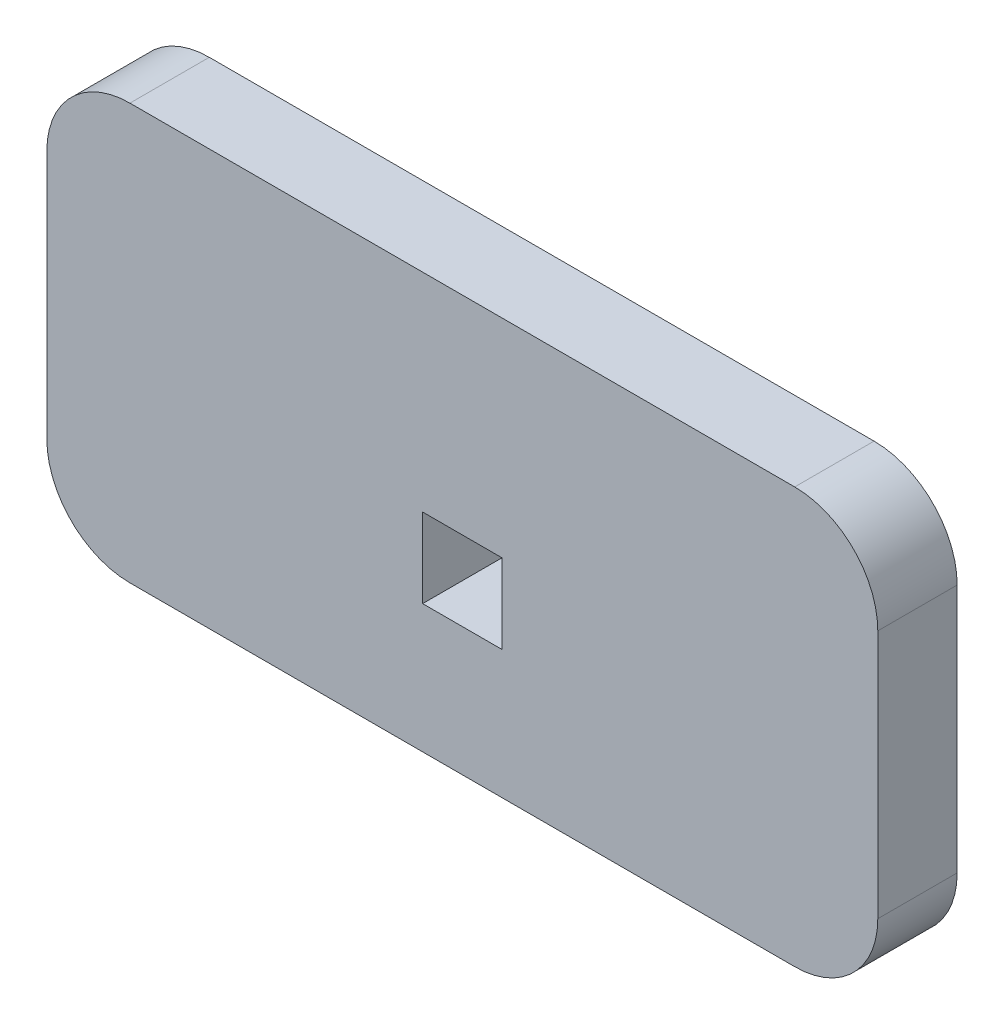
ISO-10303-21;
HEADER;
FILE_DESCRIPTION(('STEP AP214'),'2;1');
FILE_NAME('part.step','',(''),(''),'','','');
FILE_SCHEMA(('AUTOMOTIVE_DESIGN { 1 0 10303 214 1 1 1 1 }'));
ENDSEC;
DATA;
#1=APPLICATION_CONTEXT('core data for automotive mechanical design processes');
#2=APPLICATION_PROTOCOL_DEFINITION('international standard','automotive_design',2000,#1);
#3=PRODUCT_CONTEXT('',#1,'mechanical');
#4=PRODUCT('Part','Part','',(#3));
#5=PRODUCT_RELATED_PRODUCT_CATEGORY('part','',(#4));
#6=PRODUCT_DEFINITION_FORMATION('','',#4);
#7=PRODUCT_DEFINITION_CONTEXT('part definition',#1,'design');
#8=PRODUCT_DEFINITION('design','',#6,#7);
#9=PRODUCT_DEFINITION_SHAPE('','',#8);
#10=(LENGTH_UNIT() NAMED_UNIT(*) SI_UNIT(.MILLI.,.METRE.));
#11=(NAMED_UNIT(*) PLANE_ANGLE_UNIT() SI_UNIT($,.RADIAN.));
#12=(NAMED_UNIT(*) SI_UNIT($,.STERADIAN.) SOLID_ANGLE_UNIT());
#13=UNCERTAINTY_MEASURE_WITH_UNIT(LENGTH_MEASURE(1.E-05),#10,'distance_accuracy_value','');
#14=(GEOMETRIC_REPRESENTATION_CONTEXT(3) GLOBAL_UNCERTAINTY_ASSIGNED_CONTEXT((#13)) GLOBAL_UNIT_ASSIGNED_CONTEXT((#10,
#11,#12)) REPRESENTATION_CONTEXT('',''));
#15=CARTESIAN_POINT('',(0.,0.,0.));
#16=DIRECTION('',(0.,0.,1.));
#17=DIRECTION('',(1.,0.,0.));
#18=AXIS2_PLACEMENT_3D('',#15,#16,#17);
#19=CARTESIAN_POINT('',(5.,0.224799999999999,4.7752));
#20=DIRECTION('',(0.,0.,-1.));
#21=DIRECTION('',(-1.,0.,0.));
#22=AXIS2_PLACEMENT_3D('',#19,#20,#21);
#23=CYLINDRICAL_SURFACE('',#22,5.);
#24=CARTESIAN_POINT('',(5.,0.224799999999999,0.));
#25=DIRECTION('',(0.,0.,1.));
#26=DIRECTION('',(1.,0.,0.));
#27=AXIS2_PLACEMENT_3D('',#24,#25,#26);
#28=CIRCLE('',#27,5.);
#29=CARTESIAN_POINT('',(0.,0.224800000000035,0.));
#30=VERTEX_POINT('',#29);
#31=CARTESIAN_POINT('',(5.00000000000004,-4.7752,0.));
#32=VERTEX_POINT('',#31);
#33=EDGE_CURVE('E179',#30,#32,#28,.T.);
#34=ORIENTED_EDGE('',*,*,#33,.T.);
#35=DIRECTION('',(0.,0.,-1.));
#36=VECTOR('',#35,1.);
#37=CARTESIAN_POINT('',(5.00000000000004,-4.7752,4.7752));
#38=LINE('',#37,#36);
#39=CARTESIAN_POINT('',(5.00000000000004,-4.7752,4.7752));
#40=VERTEX_POINT('',#39);
#41=EDGE_CURVE('E11',#40,#32,#38,.T.);
#42=ORIENTED_EDGE('',*,*,#41,.F.);
#43=CARTESIAN_POINT('',(5.,0.224799999999999,4.7752));
#44=DIRECTION('',(0.,0.,1.));
#45=DIRECTION('',(1.,0.,0.));
#46=AXIS2_PLACEMENT_3D('',#43,#44,#45);
#47=CIRCLE('',#46,5.);
#48=CARTESIAN_POINT('',(0.,0.224800000000035,4.7752));
#49=VERTEX_POINT('',#48);
#50=EDGE_CURVE('E185',#49,#40,#47,.T.);
#51=ORIENTED_EDGE('',*,*,#50,.F.);
#52=DIRECTION('',(0.,0.,-1.));
#53=VECTOR('',#52,1.);
#54=CARTESIAN_POINT('',(0.,0.224800000000035,4.7752));
#55=LINE('',#54,#53);
#56=EDGE_CURVE('E211',#49,#30,#55,.T.);
#57=ORIENTED_EDGE('',*,*,#56,.T.);
#58=EDGE_LOOP('',(#34,#42,#51,#57));
#59=FACE_BOUND('',#58,.T.);
#60=ADVANCED_FACE('F47',(#59),#23,.T.);
#61=CARTESIAN_POINT('',(5.00000000000004,-4.7752,4.7752));
#62=DIRECTION('',(0.,1.,0.));
#63=DIRECTION('',(0.,0.,1.));
#64=AXIS2_PLACEMENT_3D('',#61,#62,#63);
#65=PLANE('',#64);
#66=DIRECTION('',(1.,0.,0.));
#67=VECTOR('',#66,1.);
#68=CARTESIAN_POINT('',(5.00000000000004,-4.7752,0.));
#69=LINE('',#68,#67);
#70=CARTESIAN_POINT('',(45.,-4.7752,0.));
#71=VERTEX_POINT('',#70);
#72=EDGE_CURVE('E215',#32,#71,#69,.T.);
#73=ORIENTED_EDGE('',*,*,#72,.T.);
#74=DIRECTION('',(0.,0.,-1.));
#75=VECTOR('',#74,1.);
#76=CARTESIAN_POINT('',(45.,-4.7752,4.7752));
#77=LINE('',#76,#75);
#78=CARTESIAN_POINT('',(45.,-4.7752,4.7752));
#79=VERTEX_POINT('',#78);
#80=EDGE_CURVE('E55',#79,#71,#77,.T.);
#81=ORIENTED_EDGE('',*,*,#80,.F.);
#82=DIRECTION('',(1.,0.,0.));
#83=VECTOR('',#82,1.);
#84=CARTESIAN_POINT('',(5.00000000000004,-4.7752,4.7752));
#85=LINE('',#84,#83);
#86=EDGE_CURVE('E189',#40,#79,#85,.T.);
#87=ORIENTED_EDGE('',*,*,#86,.F.);
#88=ORIENTED_EDGE('',*,*,#41,.T.);
#89=EDGE_LOOP('',(#73,#81,#87,#88));
#90=FACE_BOUND('',#89,.T.);
#91=ADVANCED_FACE('F284',(#90),#65,.F.);
#92=CARTESIAN_POINT('',(45.,0.224799999999999,4.7752));
#93=DIRECTION('',(0.,0.,-1.));
#94=DIRECTION('',(-1.,0.,0.));
#95=AXIS2_PLACEMENT_3D('',#92,#93,#94);
#96=CYLINDRICAL_SURFACE('',#95,5.);
#97=CARTESIAN_POINT('',(45.,0.224799999999999,0.));
#98=DIRECTION('',(0.,0.,1.));
#99=DIRECTION('',(1.,0.,0.));
#100=AXIS2_PLACEMENT_3D('',#97,#98,#99);
#101=CIRCLE('',#100,5.);
#102=CARTESIAN_POINT('',(50.,0.224800000000035,0.));
#103=VERTEX_POINT('',#102);
#104=EDGE_CURVE('E218',#71,#103,#101,.T.);
#105=ORIENTED_EDGE('',*,*,#104,.T.);
#106=DIRECTION('',(0.,0.,-1.));
#107=VECTOR('',#106,1.);
#108=CARTESIAN_POINT('',(50.,0.224800000000035,4.7752));
#109=LINE('',#108,#107);
#110=CARTESIAN_POINT('',(50.,0.224800000000035,4.7752));
#111=VERTEX_POINT('',#110);
#112=EDGE_CURVE('E254',#111,#103,#109,.T.);
#113=ORIENTED_EDGE('',*,*,#112,.F.);
#114=CARTESIAN_POINT('',(45.,0.224799999999999,4.7752));
#115=DIRECTION('',(0.,0.,1.));
#116=DIRECTION('',(1.,0.,0.));
#117=AXIS2_PLACEMENT_3D('',#114,#115,#116);
#118=CIRCLE('',#117,5.);
#119=EDGE_CURVE('E193',#79,#111,#118,.T.);
#120=ORIENTED_EDGE('',*,*,#119,.F.);
#121=ORIENTED_EDGE('',*,*,#80,.T.);
#122=EDGE_LOOP('',(#105,#113,#120,#121));
#123=FACE_BOUND('',#122,.T.);
#124=ADVANCED_FACE('F263',(#123),#96,.T.);
#125=CARTESIAN_POINT('',(50.,15.2248,4.7752));
#126=DIRECTION('',(-1.,0.,0.));
#127=DIRECTION('',(0.,0.,1.));
#128=AXIS2_PLACEMENT_3D('',#125,#126,#127);
#129=PLANE('',#128);
#130=DIRECTION('',(0.,1.,0.));
#131=VECTOR('',#130,1.);
#132=CARTESIAN_POINT('',(50.,15.2248,0.));
#133=LINE('',#132,#131);
#134=CARTESIAN_POINT('',(50.,15.2248,0.));
#135=VERTEX_POINT('',#134);
#136=EDGE_CURVE('E221',#103,#135,#133,.T.);
#137=ORIENTED_EDGE('',*,*,#136,.T.);
#138=DIRECTION('',(0.,0.,-1.));
#139=VECTOR('',#138,1.);
#140=CARTESIAN_POINT('',(50.,15.2248,4.7752));
#141=LINE('',#140,#139);
#142=CARTESIAN_POINT('',(50.,15.2248,4.7752));
#143=VERTEX_POINT('',#142);
#144=EDGE_CURVE('E250',#143,#135,#141,.T.);
#145=ORIENTED_EDGE('',*,*,#144,.F.);
#146=DIRECTION('',(0.,1.,0.));
#147=VECTOR('',#146,1.);
#148=CARTESIAN_POINT('',(50.,15.2248,4.7752));
#149=LINE('',#148,#147);
#150=EDGE_CURVE('E196',#111,#143,#149,.T.);
#151=ORIENTED_EDGE('',*,*,#150,.F.);
#152=ORIENTED_EDGE('',*,*,#112,.T.);
#153=EDGE_LOOP('',(#137,#145,#151,#152));
#154=FACE_BOUND('',#153,.T.);
#155=ADVANCED_FACE('F272',(#154),#129,.F.);
#156=CARTESIAN_POINT('',(45.,15.2248,4.7752));
#157=DIRECTION('',(0.,0.,-1.));
#158=DIRECTION('',(-1.,0.,0.));
#159=AXIS2_PLACEMENT_3D('',#156,#157,#158);
#160=CYLINDRICAL_SURFACE('',#159,5.);
#161=CARTESIAN_POINT('',(45.,15.2248,0.));
#162=DIRECTION('',(0.,0.,1.));
#163=DIRECTION('',(-1.,0.,0.));
#164=AXIS2_PLACEMENT_3D('',#161,#162,#163);
#165=CIRCLE('',#164,5.);
#166=CARTESIAN_POINT('',(45.,20.2248,0.));
#167=VERTEX_POINT('',#166);
#168=EDGE_CURVE('E224',#135,#167,#165,.T.);
#169=ORIENTED_EDGE('',*,*,#168,.T.);
#170=DIRECTION('',(0.,0.,-1.));
#171=VECTOR('',#170,1.);
#172=CARTESIAN_POINT('',(45.,20.2248,4.7752));
#173=LINE('',#172,#171);
#174=CARTESIAN_POINT('',(45.,20.2248,4.7752));
#175=VERTEX_POINT('',#174);
#176=EDGE_CURVE('E246',#175,#167,#173,.T.);
#177=ORIENTED_EDGE('',*,*,#176,.F.);
#178=CARTESIAN_POINT('',(45.,15.2248,4.7752));
#179=DIRECTION('',(0.,0.,1.));
#180=DIRECTION('',(-1.,0.,0.));
#181=AXIS2_PLACEMENT_3D('',#178,#179,#180);
#182=CIRCLE('',#181,5.);
#183=EDGE_CURVE('E199',#143,#175,#182,.T.);
#184=ORIENTED_EDGE('',*,*,#183,.F.);
#185=ORIENTED_EDGE('',*,*,#144,.T.);
#186=EDGE_LOOP('',(#169,#177,#184,#185));
#187=FACE_BOUND('',#186,.T.);
#188=ADVANCED_FACE('F276',(#187),#160,.T.);
#189=CARTESIAN_POINT('',(5.,20.2248,4.7752));
#190=DIRECTION('',(0.,-1.,0.));
#191=DIRECTION('',(0.,0.,-1.));
#192=AXIS2_PLACEMENT_3D('',#189,#190,#191);
#193=PLANE('',#192);
#194=DIRECTION('',(-1.,0.,0.));
#195=VECTOR('',#194,1.);
#196=CARTESIAN_POINT('',(5.,20.2248,0.));
#197=LINE('',#196,#195);
#198=CARTESIAN_POINT('',(5.,20.2248,0.));
#199=VERTEX_POINT('',#198);
#200=EDGE_CURVE('E227',#167,#199,#197,.T.);
#201=ORIENTED_EDGE('',*,*,#200,.T.);
#202=DIRECTION('',(0.,0.,-1.));
#203=VECTOR('',#202,1.);
#204=CARTESIAN_POINT('',(5.,20.2248,4.7752));
#205=LINE('',#204,#203);
#206=CARTESIAN_POINT('',(5.,20.2248,4.7752));
#207=VERTEX_POINT('',#206);
#208=EDGE_CURVE('E242',#207,#199,#205,.T.);
#209=ORIENTED_EDGE('',*,*,#208,.F.);
#210=DIRECTION('',(-1.,0.,0.));
#211=VECTOR('',#210,1.);
#212=CARTESIAN_POINT('',(5.,20.2248,4.7752));
#213=LINE('',#212,#211);
#214=EDGE_CURVE('E202',#175,#207,#213,.T.);
#215=ORIENTED_EDGE('',*,*,#214,.F.);
#216=ORIENTED_EDGE('',*,*,#176,.T.);
#217=EDGE_LOOP('',(#201,#209,#215,#216));
#218=FACE_BOUND('',#217,.T.);
#219=ADVANCED_FACE('F297',(#218),#193,.F.);
#220=CARTESIAN_POINT('',(5.,15.2248,4.7752));
#221=DIRECTION('',(0.,0.,-1.));
#222=DIRECTION('',(-1.,0.,0.));
#223=AXIS2_PLACEMENT_3D('',#220,#221,#222);
#224=CYLINDRICAL_SURFACE('',#223,5.);
#225=CARTESIAN_POINT('',(5.,15.2248,0.));
#226=DIRECTION('',(0.,0.,1.));
#227=DIRECTION('',(-1.,0.,0.));
#228=AXIS2_PLACEMENT_3D('',#225,#226,#227);
#229=CIRCLE('',#228,5.);
#230=CARTESIAN_POINT('',(0.,15.2248,0.));
#231=VERTEX_POINT('',#230);
#232=EDGE_CURVE('E230',#199,#231,#229,.T.);
#233=ORIENTED_EDGE('',*,*,#232,.T.);
#234=DIRECTION('',(0.,0.,-1.));
#235=VECTOR('',#234,1.);
#236=CARTESIAN_POINT('',(0.,15.2248,4.7752));
#237=LINE('',#236,#235);
#238=CARTESIAN_POINT('',(0.,15.2248,4.7752));
#239=VERTEX_POINT('',#238);
#240=EDGE_CURVE('E238',#239,#231,#237,.T.);
#241=ORIENTED_EDGE('',*,*,#240,.F.);
#242=CARTESIAN_POINT('',(5.,15.2248,4.7752));
#243=DIRECTION('',(0.,0.,1.));
#244=DIRECTION('',(-1.,0.,0.));
#245=AXIS2_PLACEMENT_3D('',#242,#243,#244);
#246=CIRCLE('',#245,5.);
#247=EDGE_CURVE('E205',#207,#239,#246,.T.);
#248=ORIENTED_EDGE('',*,*,#247,.F.);
#249=ORIENTED_EDGE('',*,*,#208,.T.);
#250=EDGE_LOOP('',(#233,#241,#248,#249));
#251=FACE_BOUND('',#250,.T.);
#252=ADVANCED_FACE('F295',(#251),#224,.T.);
#253=CARTESIAN_POINT('',(0.,0.224800000000035,4.7752));
#254=DIRECTION('',(1.,0.,0.));
#255=DIRECTION('',(0.,1.,0.));
#256=AXIS2_PLACEMENT_3D('',#253,#254,#255);
#257=PLANE('',#256);
#258=DIRECTION('',(0.,-1.,0.));
#259=VECTOR('',#258,1.);
#260=CARTESIAN_POINT('',(0.,0.224800000000035,0.));
#261=LINE('',#260,#259);
#262=EDGE_CURVE('E190',#231,#30,#261,.T.);
#263=ORIENTED_EDGE('',*,*,#262,.T.);
#264=ORIENTED_EDGE('',*,*,#56,.F.);
#265=DIRECTION('',(0.,-1.,0.));
#266=VECTOR('',#265,1.);
#267=CARTESIAN_POINT('',(0.,0.224800000000035,4.7752));
#268=LINE('',#267,#266);
#269=EDGE_CURVE('E208',#239,#49,#268,.T.);
#270=ORIENTED_EDGE('',*,*,#269,.F.);
#271=ORIENTED_EDGE('',*,*,#240,.T.);
#272=EDGE_LOOP('',(#263,#264,#270,#271));
#273=FACE_BOUND('',#272,.T.);
#274=ADVANCED_FACE('F290',(#273),#257,.F.);
#275=CARTESIAN_POINT('',(5.,0.224799999999999,4.7752));
#276=DIRECTION('',(0.,0.,1.));
#277=DIRECTION('',(1.,0.,0.));
#278=AXIS2_PLACEMENT_3D('',#275,#276,#277);
#279=PLANE('',#278);
#280=DIRECTION('',(0.,1.,0.));
#281=VECTOR('',#280,1.);
#282=CARTESIAN_POINT('',(27.3876,7.72480000000002,4.7752));
#283=LINE('',#282,#281);
#284=CARTESIAN_POINT('',(27.3876,2.94960000000002,4.7752));
#285=VERTEX_POINT('',#284);
#286=CARTESIAN_POINT('',(27.3876,7.72480000000002,4.7752));
#287=VERTEX_POINT('',#286);
#288=EDGE_CURVE('E62',#285,#287,#283,.T.);
#289=ORIENTED_EDGE('',*,*,#288,.F.);
#290=DIRECTION('',(1.,0.,0.));
#291=VECTOR('',#290,1.);
#292=CARTESIAN_POINT('',(22.6124,2.94960000000002,4.7752));
#293=LINE('',#292,#291);
#294=CARTESIAN_POINT('',(22.6124,2.94960000000002,4.7752));
#295=VERTEX_POINT('',#294);
#296=EDGE_CURVE('E157',#295,#285,#293,.T.);
#297=ORIENTED_EDGE('',*,*,#296,.F.);
#298=DIRECTION('',(0.,-1.,0.));
#299=VECTOR('',#298,1.);
#300=CARTESIAN_POINT('',(22.6124,7.72480000000002,4.7752));
#301=LINE('',#300,#299);
#302=CARTESIAN_POINT('',(22.6124,7.72480000000002,4.7752));
#303=VERTEX_POINT('',#302);
#304=EDGE_CURVE('E161',#303,#295,#301,.T.);
#305=ORIENTED_EDGE('',*,*,#304,.F.);
#306=DIRECTION('',(-1.,0.,0.));
#307=VECTOR('',#306,1.);
#308=CARTESIAN_POINT('',(27.3876,7.72480000000002,4.7752));
#309=LINE('',#308,#307);
#310=EDGE_CURVE('E170',#287,#303,#309,.T.);
#311=ORIENTED_EDGE('',*,*,#310,.F.);
#312=EDGE_LOOP('',(#289,#297,#305,#311));
#313=FACE_BOUND('',#312,.T.);
#314=ORIENTED_EDGE('',*,*,#50,.T.);
#315=ORIENTED_EDGE('',*,*,#86,.T.);
#316=ORIENTED_EDGE('',*,*,#119,.T.);
#317=ORIENTED_EDGE('',*,*,#150,.T.);
#318=ORIENTED_EDGE('',*,*,#183,.T.);
#319=ORIENTED_EDGE('',*,*,#214,.T.);
#320=ORIENTED_EDGE('',*,*,#247,.T.);
#321=ORIENTED_EDGE('',*,*,#269,.T.);
#322=EDGE_LOOP('',(#314,#315,#316,#317,#318,#319,#320,#321));
#323=FACE_BOUND('',#322,.T.);
#324=ADVANCED_FACE('F280',(#313,#323),#279,.T.);
#325=CARTESIAN_POINT('',(5.,0.224799999999999,0.));
#326=DIRECTION('',(0.,0.,1.));
#327=DIRECTION('',(1.,0.,0.));
#328=AXIS2_PLACEMENT_3D('',#325,#326,#327);
#329=PLANE('',#328);
#330=DIRECTION('',(1.,0.,0.));
#331=VECTOR('',#330,1.);
#332=CARTESIAN_POINT('',(22.6124,2.94960000000002,0.));
#333=LINE('',#332,#331);
#334=CARTESIAN_POINT('',(22.6124,2.94960000000002,0.));
#335=VERTEX_POINT('',#334);
#336=CARTESIAN_POINT('',(27.3876,2.94960000000002,0.));
#337=VERTEX_POINT('',#336);
#338=EDGE_CURVE('E145',#335,#337,#333,.T.);
#339=ORIENTED_EDGE('',*,*,#338,.T.);
#340=DIRECTION('',(0.,1.,0.));
#341=VECTOR('',#340,1.);
#342=CARTESIAN_POINT('',(27.3876,7.72480000000002,0.));
#343=LINE('',#342,#341);
#344=CARTESIAN_POINT('',(27.3876,7.72480000000002,0.));
#345=VERTEX_POINT('',#344);
#346=EDGE_CURVE('E138',#337,#345,#343,.T.);
#347=ORIENTED_EDGE('',*,*,#346,.T.);
#348=DIRECTION('',(-1.,0.,0.));
#349=VECTOR('',#348,1.);
#350=CARTESIAN_POINT('',(27.3876,7.72480000000002,0.));
#351=LINE('',#350,#349);
#352=CARTESIAN_POINT('',(22.6124,7.72480000000002,0.));
#353=VERTEX_POINT('',#352);
#354=EDGE_CURVE('E148',#345,#353,#351,.T.);
#355=ORIENTED_EDGE('',*,*,#354,.T.);
#356=DIRECTION('',(0.,-1.,0.));
#357=VECTOR('',#356,1.);
#358=CARTESIAN_POINT('',(22.6124,7.72480000000002,0.));
#359=LINE('',#358,#357);
#360=EDGE_CURVE('E70',#353,#335,#359,.T.);
#361=ORIENTED_EDGE('',*,*,#360,.T.);
#362=EDGE_LOOP('',(#339,#347,#355,#361));
#363=FACE_BOUND('',#362,.T.);
#364=ORIENTED_EDGE('',*,*,#33,.F.);
#365=ORIENTED_EDGE('',*,*,#262,.F.);
#366=ORIENTED_EDGE('',*,*,#232,.F.);
#367=ORIENTED_EDGE('',*,*,#200,.F.);
#368=ORIENTED_EDGE('',*,*,#168,.F.);
#369=ORIENTED_EDGE('',*,*,#136,.F.);
#370=ORIENTED_EDGE('',*,*,#104,.F.);
#371=ORIENTED_EDGE('',*,*,#72,.F.);
#372=EDGE_LOOP('',(#364,#365,#366,#367,#368,#369,#370,#371));
#373=FACE_BOUND('',#372,.T.);
#374=ADVANCED_FACE('F153',(#363,#373),#329,.F.);
#375=CARTESIAN_POINT('',(27.3876,7.72480000000002,0.));
#376=DIRECTION('',(1.,0.,0.));
#377=DIRECTION('',(0.,1.,0.));
#378=AXIS2_PLACEMENT_3D('',#375,#376,#377);
#379=PLANE('',#378);
#380=ORIENTED_EDGE('',*,*,#288,.T.);
#381=DIRECTION('',(0.,0.,1.));
#382=VECTOR('',#381,1.);
#383=CARTESIAN_POINT('',(27.3876,7.72480000000002,0.));
#384=LINE('',#383,#382);
#385=EDGE_CURVE('E134',#345,#287,#384,.T.);
#386=ORIENTED_EDGE('',*,*,#385,.F.);
#387=ORIENTED_EDGE('',*,*,#346,.F.);
#388=DIRECTION('',(0.,0.,1.));
#389=VECTOR('',#388,1.);
#390=CARTESIAN_POINT('',(27.3876,2.94960000000002,0.));
#391=LINE('',#390,#389);
#392=EDGE_CURVE('E176',#337,#285,#391,.T.);
#393=ORIENTED_EDGE('',*,*,#392,.T.);
#394=EDGE_LOOP('',(#380,#386,#387,#393));
#395=FACE_BOUND('',#394,.T.);
#396=ADVANCED_FACE('F136',(#395),#379,.F.);
#397=CARTESIAN_POINT('',(22.6124,2.94960000000002,0.));
#398=DIRECTION('',(0.,-1.,0.));
#399=DIRECTION('',(0.,0.,-1.));
#400=AXIS2_PLACEMENT_3D('',#397,#398,#399);
#401=PLANE('',#400);
#402=ORIENTED_EDGE('',*,*,#296,.T.);
#403=ORIENTED_EDGE('',*,*,#392,.F.);
#404=ORIENTED_EDGE('',*,*,#338,.F.);
#405=DIRECTION('',(0.,0.,1.));
#406=VECTOR('',#405,1.);
#407=CARTESIAN_POINT('',(22.6124,2.94960000000002,0.));
#408=LINE('',#407,#406);
#409=EDGE_CURVE('E180',#335,#295,#408,.T.);
#410=ORIENTED_EDGE('',*,*,#409,.T.);
#411=EDGE_LOOP('',(#402,#403,#404,#410));
#412=FACE_BOUND('',#411,.T.);
#413=ADVANCED_FACE('F370',(#412),#401,.F.);
#414=CARTESIAN_POINT('',(22.6124,7.72480000000002,0.));
#415=DIRECTION('',(-1.,0.,0.));
#416=DIRECTION('',(0.,-1.,0.));
#417=AXIS2_PLACEMENT_3D('',#414,#415,#416);
#418=PLANE('',#417);
#419=ORIENTED_EDGE('',*,*,#304,.T.);
#420=ORIENTED_EDGE('',*,*,#409,.F.);
#421=ORIENTED_EDGE('',*,*,#360,.F.);
#422=DIRECTION('',(0.,0.,1.));
#423=VECTOR('',#422,1.);
#424=CARTESIAN_POINT('',(22.6124,7.72480000000002,0.));
#425=LINE('',#424,#423);
#426=EDGE_CURVE('E144',#353,#303,#425,.T.);
#427=ORIENTED_EDGE('',*,*,#426,.T.);
#428=EDGE_LOOP('',(#419,#420,#421,#427));
#429=FACE_BOUND('',#428,.T.);
#430=ADVANCED_FACE('F379',(#429),#418,.F.);
#431=CARTESIAN_POINT('',(27.3876,7.72480000000002,0.));
#432=DIRECTION('',(0.,1.,0.));
#433=DIRECTION('',(0.,0.,1.));
#434=AXIS2_PLACEMENT_3D('',#431,#432,#433);
#435=PLANE('',#434);
#436=ORIENTED_EDGE('',*,*,#310,.T.);
#437=ORIENTED_EDGE('',*,*,#426,.F.);
#438=ORIENTED_EDGE('',*,*,#354,.F.);
#439=ORIENTED_EDGE('',*,*,#385,.T.);
#440=EDGE_LOOP('',(#436,#437,#438,#439));
#441=FACE_BOUND('',#440,.T.);
#442=ADVANCED_FACE('F149',(#441),#435,.F.);
#443=CLOSED_SHELL('',(#60,#91,#124,#155,#188,#219,#252,#274,#324,#374,#396,#413,#430,#442));
#444=MANIFOLD_SOLID_BREP('B2',#443);
#445=ADVANCED_BREP_SHAPE_REPRESENTATION('',(#18,#444),#14);
#446=SHAPE_DEFINITION_REPRESENTATION(#9,#445);
ENDSEC;
END-ISO-10303-21;
